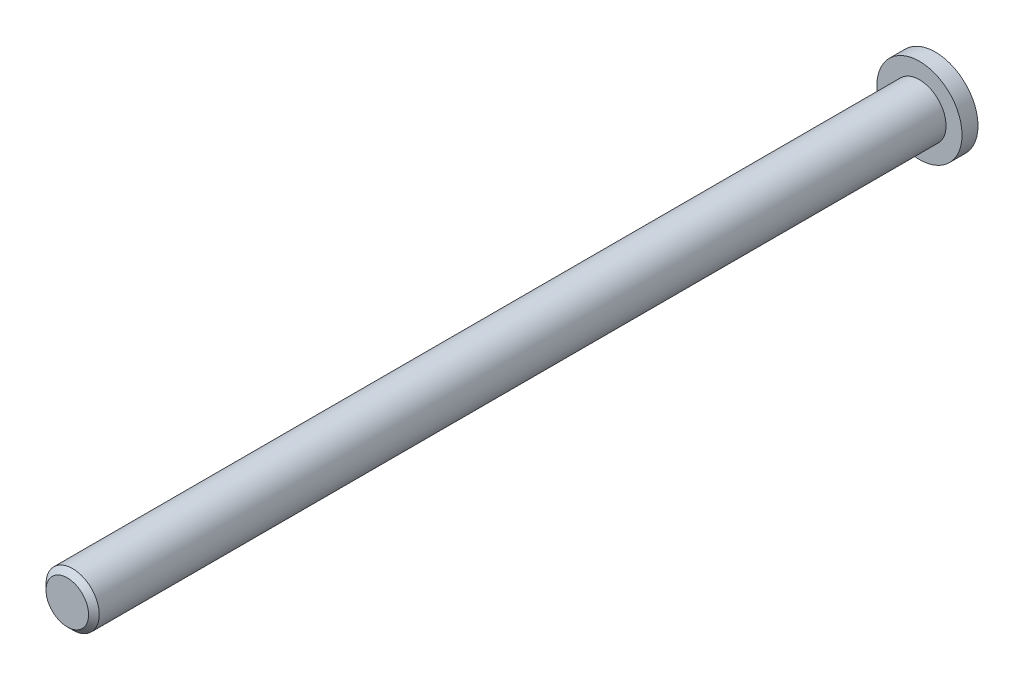
ISO-10303-21;
HEADER;
FILE_DESCRIPTION(('STEP AP214'),'2;1');
FILE_NAME('part.step','',(''),(''),'','','');
FILE_SCHEMA(('AUTOMOTIVE_DESIGN { 1 0 10303 214 1 1 1 1 }'));
ENDSEC;
DATA;
#1=APPLICATION_CONTEXT('core data for automotive mechanical design processes');
#2=APPLICATION_PROTOCOL_DEFINITION('international standard','automotive_design',2000,#1);
#3=PRODUCT_CONTEXT('',#1,'mechanical');
#4=PRODUCT('Part','Part','',(#3));
#5=PRODUCT_RELATED_PRODUCT_CATEGORY('part','',(#4));
#6=PRODUCT_DEFINITION_FORMATION('','',#4);
#7=PRODUCT_DEFINITION_CONTEXT('part definition',#1,'design');
#8=PRODUCT_DEFINITION('design','',#6,#7);
#9=PRODUCT_DEFINITION_SHAPE('','',#8);
#10=(LENGTH_UNIT() NAMED_UNIT(*) SI_UNIT(.MILLI.,.METRE.));
#11=(NAMED_UNIT(*) PLANE_ANGLE_UNIT() SI_UNIT($,.RADIAN.));
#12=(NAMED_UNIT(*) SI_UNIT($,.STERADIAN.) SOLID_ANGLE_UNIT());
#13=UNCERTAINTY_MEASURE_WITH_UNIT(LENGTH_MEASURE(1.E-05),#10,'distance_accuracy_value','');
#14=(GEOMETRIC_REPRESENTATION_CONTEXT(3) GLOBAL_UNCERTAINTY_ASSIGNED_CONTEXT((#13)) GLOBAL_UNIT_ASSIGNED_CONTEXT((#10,
#11,#12)) REPRESENTATION_CONTEXT('',''));
#15=CARTESIAN_POINT('',(0.,0.,0.));
#16=DIRECTION('',(0.,0.,1.));
#17=DIRECTION('',(1.,0.,0.));
#18=AXIS2_PLACEMENT_3D('',#15,#16,#17);
#19=CARTESIAN_POINT('',(0.,0.,1.5));
#20=DIRECTION('',(0.,0.,1.));
#21=DIRECTION('',(1.,0.,0.));
#22=AXIS2_PLACEMENT_3D('',#19,#20,#21);
#23=PLANE('',#22);
#24=CARTESIAN_POINT('',(0.,0.,1.5));
#25=DIRECTION('',(0.,0.,1.));
#26=DIRECTION('',(1.,0.,0.));
#27=AXIS2_PLACEMENT_3D('',#24,#25,#26);
#28=CIRCLE('',#27,4.);
#29=CARTESIAN_POINT('',(4.,0.,1.5));
#30=VERTEX_POINT('',#29);
#31=EDGE_CURVE('E42',#30,#30,#28,.T.);
#32=ORIENTED_EDGE('',*,*,#31,.T.);
#33=EDGE_LOOP('',(#32));
#34=FACE_BOUND('',#33,.T.);
#35=CARTESIAN_POINT('',(0.,0.,1.5));
#36=DIRECTION('',(0.,0.,1.));
#37=DIRECTION('',(1.,0.,0.));
#38=AXIS2_PLACEMENT_3D('',#35,#36,#37);
#39=CIRCLE('',#38,2.5);
#40=CARTESIAN_POINT('',(2.5,0.,1.5));
#41=VERTEX_POINT('',#40);
#42=EDGE_CURVE('E50',#41,#41,#39,.T.);
#43=ORIENTED_EDGE('',*,*,#42,.F.);
#44=EDGE_LOOP('',(#43));
#45=FACE_BOUND('',#44,.T.);
#46=ADVANCED_FACE('F31',(#34,#45),#23,.T.);
#47=CARTESIAN_POINT('',(0.,0.,1.5));
#48=DIRECTION('',(0.,0.,-1.));
#49=DIRECTION('',(-1.,0.,0.));
#50=AXIS2_PLACEMENT_3D('',#47,#48,#49);
#51=CYLINDRICAL_SURFACE('',#50,4.);
#52=ORIENTED_EDGE('',*,*,#31,.F.);
#53=EDGE_LOOP('',(#52));
#54=FACE_BOUND('',#53,.T.);
#55=CARTESIAN_POINT('',(0.,0.,0.));
#56=DIRECTION('',(0.,0.,1.));
#57=DIRECTION('',(1.,0.,0.));
#58=AXIS2_PLACEMENT_3D('',#55,#56,#57);
#59=CIRCLE('',#58,4.);
#60=CARTESIAN_POINT('',(4.,0.,0.));
#61=VERTEX_POINT('',#60);
#62=EDGE_CURVE('E46',#61,#61,#59,.T.);
#63=ORIENTED_EDGE('',*,*,#62,.T.);
#64=EDGE_LOOP('',(#63));
#65=FACE_BOUND('',#64,.T.);
#66=ADVANCED_FACE('F58',(#54,#65),#51,.T.);
#67=CARTESIAN_POINT('',(0.,0.,0.));
#68=DIRECTION('',(0.,0.,1.));
#69=DIRECTION('',(1.,0.,0.));
#70=AXIS2_PLACEMENT_3D('',#67,#68,#69);
#71=PLANE('',#70);
#72=ORIENTED_EDGE('',*,*,#62,.F.);
#73=EDGE_LOOP('',(#72));
#74=FACE_BOUND('',#73,.T.);
#75=ADVANCED_FACE('F64',(#74),#71,.F.);
#76=CARTESIAN_POINT('',(0.,0.,81.5));
#77=DIRECTION('',(0.,0.,-1.));
#78=DIRECTION('',(-1.,0.,0.));
#79=AXIS2_PLACEMENT_3D('',#76,#77,#78);
#80=CYLINDRICAL_SURFACE('',#79,2.5);
#81=CARTESIAN_POINT('',(0.,0.,81.));
#82=DIRECTION('',(0.,0.,1.));
#83=DIRECTION('',(1.,0.,0.));
#84=AXIS2_PLACEMENT_3D('',#81,#82,#83);
#85=CIRCLE('',#84,2.5);
#86=CARTESIAN_POINT('',(2.5,0.,81.));
#87=VERTEX_POINT('',#86);
#88=EDGE_CURVE('E10',#87,#87,#85,.F.);
#89=ORIENTED_EDGE('',*,*,#88,.T.);
#90=EDGE_LOOP('',(#89));
#91=FACE_BOUND('',#90,.T.);
#92=ORIENTED_EDGE('',*,*,#42,.T.);
#93=EDGE_LOOP('',(#92));
#94=FACE_BOUND('',#93,.T.);
#95=ADVANCED_FACE('F55',(#91,#94),#80,.T.);
#96=CARTESIAN_POINT('',(0.,0.,81.5));
#97=DIRECTION('',(0.,0.,1.));
#98=DIRECTION('',(1.,0.,0.));
#99=AXIS2_PLACEMENT_3D('',#96,#97,#98);
#100=PLANE('',#99);
#101=CARTESIAN_POINT('',(0.,0.,81.5));
#102=DIRECTION('',(0.,0.,1.));
#103=DIRECTION('',(1.,0.,0.));
#104=AXIS2_PLACEMENT_3D('',#101,#102,#103);
#105=CIRCLE('',#104,1.99999999999999);
#106=CARTESIAN_POINT('',(1.99999999999999,0.,81.5));
#107=VERTEX_POINT('',#106);
#108=EDGE_CURVE('E38',#107,#107,#105,.T.);
#109=ORIENTED_EDGE('',*,*,#108,.T.);
#110=EDGE_LOOP('',(#109));
#111=FACE_BOUND('',#110,.T.);
#112=ADVANCED_FACE('F74',(#111),#100,.T.);
#113=CARTESIAN_POINT('',(0.,0.,81.5));
#114=DIRECTION('',(0.,0.,-1.));
#115=DIRECTION('',(-1.,0.,0.));
#116=AXIS2_PLACEMENT_3D('',#113,#114,#115);
#117=CONICAL_SURFACE('',#116,1.99999999999999,0.785398163397467);
#118=ORIENTED_EDGE('',*,*,#88,.F.);
#119=EDGE_LOOP('',(#118));
#120=FACE_BOUND('',#119,.T.);
#121=ORIENTED_EDGE('',*,*,#108,.F.);
#122=EDGE_LOOP('',(#121));
#123=FACE_BOUND('',#122,.T.);
#124=ADVANCED_FACE('F33',(#120,#123),#117,.T.);
#125=CLOSED_SHELL('',(#46,#66,#75,#95,#112,#124));
#126=MANIFOLD_SOLID_BREP('B2',#125);
#127=ADVANCED_BREP_SHAPE_REPRESENTATION('',(#18,#126),#14);
#128=SHAPE_DEFINITION_REPRESENTATION(#9,#127);
ENDSEC;
END-ISO-10303-21;
